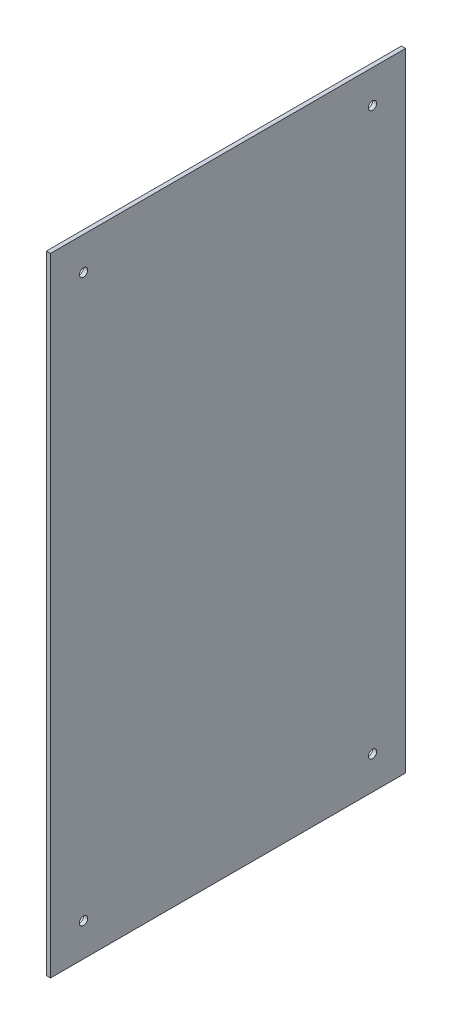
ISO-10303-21;
HEADER;
FILE_DESCRIPTION(('STEP AP214'),'2;1');
FILE_NAME('part.step','',(''),(''),'','','');
FILE_SCHEMA(('AUTOMOTIVE_DESIGN { 1 0 10303 214 1 1 1 1 }'));
ENDSEC;
DATA;
#1=APPLICATION_CONTEXT('core data for automotive mechanical design processes');
#2=APPLICATION_PROTOCOL_DEFINITION('international standard','automotive_design',2000,#1);
#3=PRODUCT_CONTEXT('',#1,'mechanical');
#4=PRODUCT('Part','Part','',(#3));
#5=PRODUCT_RELATED_PRODUCT_CATEGORY('part','',(#4));
#6=PRODUCT_DEFINITION_FORMATION('','',#4);
#7=PRODUCT_DEFINITION_CONTEXT('part definition',#1,'design');
#8=PRODUCT_DEFINITION('design','',#6,#7);
#9=PRODUCT_DEFINITION_SHAPE('','',#8);
#10=(LENGTH_UNIT() NAMED_UNIT(*) SI_UNIT(.MILLI.,.METRE.));
#11=(NAMED_UNIT(*) PLANE_ANGLE_UNIT() SI_UNIT($,.RADIAN.));
#12=(NAMED_UNIT(*) SI_UNIT($,.STERADIAN.) SOLID_ANGLE_UNIT());
#13=UNCERTAINTY_MEASURE_WITH_UNIT(LENGTH_MEASURE(1.E-05),#10,'distance_accuracy_value','');
#14=(GEOMETRIC_REPRESENTATION_CONTEXT(3) GLOBAL_UNCERTAINTY_ASSIGNED_CONTEXT((#13)) GLOBAL_UNIT_ASSIGNED_CONTEXT((#10,
#11,#12)) REPRESENTATION_CONTEXT('',''));
#15=CARTESIAN_POINT('',(0.,0.,0.));
#16=DIRECTION('',(0.,0.,1.));
#17=DIRECTION('',(1.,0.,0.));
#18=AXIS2_PLACEMENT_3D('',#15,#16,#17);
#19=CARTESIAN_POINT('',(3.175,0.,0.));
#20=DIRECTION('',(1.,0.,0.));
#21=DIRECTION('',(0.,0.,-1.));
#22=AXIS2_PLACEMENT_3D('',#19,#20,#21);
#23=PLANE('',#22);
#24=CARTESIAN_POINT('',(3.175,25.4,-247.65));
#25=DIRECTION('',(1.,0.,0.));
#26=DIRECTION('',(0.,0.,-1.));
#27=AXIS2_PLACEMENT_3D('',#24,#25,#26);
#28=CIRCLE('',#27,3.175);
#29=CARTESIAN_POINT('',(3.175,25.4,-250.825));
#30=VERTEX_POINT('',#29);
#31=EDGE_CURVE('E92',#30,#30,#28,.F.);
#32=ORIENTED_EDGE('',*,*,#31,.T.);
#33=EDGE_LOOP('',(#32));
#34=FACE_BOUND('',#33,.T.);
#35=CARTESIAN_POINT('',(3.175,25.4,-25.4));
#36=DIRECTION('',(1.,0.,0.));
#37=DIRECTION('',(0.,0.,-1.));
#38=AXIS2_PLACEMENT_3D('',#35,#36,#37);
#39=CIRCLE('',#38,3.175);
#40=CARTESIAN_POINT('',(3.175,25.4,-28.575));
#41=VERTEX_POINT('',#40);
#42=EDGE_CURVE('E95',#41,#41,#39,.F.);
#43=ORIENTED_EDGE('',*,*,#42,.T.);
#44=EDGE_LOOP('',(#43));
#45=FACE_BOUND('',#44,.T.);
#46=CARTESIAN_POINT('',(3.175,457.2,-247.65));
#47=DIRECTION('',(1.,0.,0.));
#48=DIRECTION('',(0.,0.,-1.));
#49=AXIS2_PLACEMENT_3D('',#46,#47,#48);
#50=CIRCLE('',#49,3.175);
#51=CARTESIAN_POINT('',(3.175,457.2,-250.825));
#52=VERTEX_POINT('',#51);
#53=EDGE_CURVE('E97',#52,#52,#50,.F.);
#54=ORIENTED_EDGE('',*,*,#53,.T.);
#55=EDGE_LOOP('',(#54));
#56=FACE_BOUND('',#55,.T.);
#57=CARTESIAN_POINT('',(3.175,457.2,-25.4));
#58=DIRECTION('',(1.,0.,0.));
#59=DIRECTION('',(0.,0.,-1.));
#60=AXIS2_PLACEMENT_3D('',#57,#58,#59);
#61=CIRCLE('',#60,3.175);
#62=CARTESIAN_POINT('',(3.175,457.2,-28.575));
#63=VERTEX_POINT('',#62);
#64=EDGE_CURVE('E20',#63,#63,#61,.F.);
#65=ORIENTED_EDGE('',*,*,#64,.T.);
#66=EDGE_LOOP('',(#65));
#67=FACE_BOUND('',#66,.T.);
#68=DIRECTION('',(0.,1.,0.));
#69=VECTOR('',#68,1.);
#70=CARTESIAN_POINT('',(3.175,482.6,0.));
#71=LINE('',#70,#69);
#72=CARTESIAN_POINT('',(3.175,0.,0.));
#73=VERTEX_POINT('',#72);
#74=CARTESIAN_POINT('',(3.175,482.6,0.));
#75=VERTEX_POINT('',#74);
#76=EDGE_CURVE('E71',#73,#75,#71,.T.);
#77=ORIENTED_EDGE('',*,*,#76,.F.);
#78=DIRECTION('',(0.,0.,-1.));
#79=VECTOR('',#78,1.);
#80=CARTESIAN_POINT('',(3.175,0.,0.));
#81=LINE('',#80,#79);
#82=CARTESIAN_POINT('',(3.175,0.,-273.05));
#83=VERTEX_POINT('',#82);
#84=EDGE_CURVE('E68',#83,#73,#81,.F.);
#85=ORIENTED_EDGE('',*,*,#84,.F.);
#86=DIRECTION('',(0.,1.,0.));
#87=VECTOR('',#86,1.);
#88=CARTESIAN_POINT('',(3.175,0.,-273.05));
#89=LINE('',#88,#87);
#90=CARTESIAN_POINT('',(3.175,482.6,-273.05));
#91=VERTEX_POINT('',#90);
#92=EDGE_CURVE('E59',#91,#83,#89,.F.);
#93=ORIENTED_EDGE('',*,*,#92,.F.);
#94=DIRECTION('',(0.,0.,1.));
#95=VECTOR('',#94,1.);
#96=CARTESIAN_POINT('',(3.175,482.6,-273.05));
#97=LINE('',#96,#95);
#98=EDGE_CURVE('E54',#75,#91,#97,.F.);
#99=ORIENTED_EDGE('',*,*,#98,.F.);
#100=EDGE_LOOP('',(#77,#85,#93,#99));
#101=FACE_BOUND('',#100,.T.);
#102=ADVANCED_FACE('F17',(#34,#45,#56,#67,#101),#23,.T.);
#103=CARTESIAN_POINT('',(0.,0.,0.));
#104=DIRECTION('',(0.,-1.,0.));
#105=DIRECTION('',(0.,0.,-1.));
#106=AXIS2_PLACEMENT_3D('',#103,#104,#105);
#107=PLANE('',#106);
#108=DIRECTION('',(1.,0.,0.));
#109=VECTOR('',#108,1.);
#110=CARTESIAN_POINT('',(0.,0.,0.));
#111=LINE('',#110,#109);
#112=CARTESIAN_POINT('',(0.,0.,0.));
#113=VERTEX_POINT('',#112);
#114=EDGE_CURVE('E105',#113,#73,#111,.T.);
#115=ORIENTED_EDGE('',*,*,#114,.F.);
#116=DIRECTION('',(0.,0.,-1.));
#117=VECTOR('',#116,1.);
#118=CARTESIAN_POINT('',(0.,0.,0.));
#119=LINE('',#118,#117);
#120=CARTESIAN_POINT('',(0.,0.,-273.05));
#121=VERTEX_POINT('',#120);
#122=EDGE_CURVE('E78',#113,#121,#119,.T.);
#123=ORIENTED_EDGE('',*,*,#122,.T.);
#124=DIRECTION('',(-1.,0.,0.));
#125=VECTOR('',#124,1.);
#126=CARTESIAN_POINT('',(0.,0.,-273.05));
#127=LINE('',#126,#125);
#128=EDGE_CURVE('E64',#83,#121,#127,.T.);
#129=ORIENTED_EDGE('',*,*,#128,.F.);
#130=ORIENTED_EDGE('',*,*,#84,.T.);
#131=EDGE_LOOP('',(#115,#123,#129,#130));
#132=FACE_BOUND('',#131,.T.);
#133=ADVANCED_FACE('F77',(#132),#107,.T.);
#134=CARTESIAN_POINT('',(0.,0.,-273.05));
#135=DIRECTION('',(0.,0.,-1.));
#136=DIRECTION('',(-1.,0.,0.));
#137=AXIS2_PLACEMENT_3D('',#134,#135,#136);
#138=PLANE('',#137);
#139=ORIENTED_EDGE('',*,*,#128,.T.);
#140=DIRECTION('',(0.,1.,0.));
#141=VECTOR('',#140,1.);
#142=CARTESIAN_POINT('',(0.,0.,-273.05));
#143=LINE('',#142,#141);
#144=CARTESIAN_POINT('',(0.,482.6,-273.05));
#145=VERTEX_POINT('',#144);
#146=EDGE_CURVE('E116',#121,#145,#143,.T.);
#147=ORIENTED_EDGE('',*,*,#146,.T.);
#148=DIRECTION('',(1.,0.,0.));
#149=VECTOR('',#148,1.);
#150=CARTESIAN_POINT('',(0.,482.6,-273.05));
#151=LINE('',#150,#149);
#152=EDGE_CURVE('E66',#91,#145,#151,.F.);
#153=ORIENTED_EDGE('',*,*,#152,.F.);
#154=ORIENTED_EDGE('',*,*,#92,.T.);
#155=EDGE_LOOP('',(#139,#147,#153,#154));
#156=FACE_BOUND('',#155,.T.);
#157=ADVANCED_FACE('F61',(#156),#138,.T.);
#158=CARTESIAN_POINT('',(0.,482.6,-273.05));
#159=DIRECTION('',(0.,1.,0.));
#160=DIRECTION('',(0.,0.,1.));
#161=AXIS2_PLACEMENT_3D('',#158,#159,#160);
#162=PLANE('',#161);
#163=ORIENTED_EDGE('',*,*,#152,.T.);
#164=DIRECTION('',(0.,0.,-1.));
#165=VECTOR('',#164,1.);
#166=CARTESIAN_POINT('',(0.,482.6,0.));
#167=LINE('',#166,#165);
#168=CARTESIAN_POINT('',(0.,482.6,0.));
#169=VERTEX_POINT('',#168);
#170=EDGE_CURVE('E113',#145,#169,#167,.F.);
#171=ORIENTED_EDGE('',*,*,#170,.T.);
#172=DIRECTION('',(1.,0.,0.));
#173=VECTOR('',#172,1.);
#174=CARTESIAN_POINT('',(0.,482.6,0.));
#175=LINE('',#174,#173);
#176=EDGE_CURVE('E35',#75,#169,#175,.F.);
#177=ORIENTED_EDGE('',*,*,#176,.F.);
#178=ORIENTED_EDGE('',*,*,#98,.T.);
#179=EDGE_LOOP('',(#163,#171,#177,#178));
#180=FACE_BOUND('',#179,.T.);
#181=ADVANCED_FACE('F112',(#180),#162,.T.);
#182=CARTESIAN_POINT('',(0.,482.6,0.));
#183=DIRECTION('',(0.,0.,1.));
#184=DIRECTION('',(1.,0.,0.));
#185=AXIS2_PLACEMENT_3D('',#182,#183,#184);
#186=PLANE('',#185);
#187=ORIENTED_EDGE('',*,*,#176,.T.);
#188=DIRECTION('',(0.,1.,0.));
#189=VECTOR('',#188,1.);
#190=CARTESIAN_POINT('',(0.,0.,0.));
#191=LINE('',#190,#189);
#192=EDGE_CURVE('E91',#169,#113,#191,.F.);
#193=ORIENTED_EDGE('',*,*,#192,.T.);
#194=ORIENTED_EDGE('',*,*,#114,.T.);
#195=ORIENTED_EDGE('',*,*,#76,.T.);
#196=EDGE_LOOP('',(#187,#193,#194,#195));
#197=FACE_BOUND('',#196,.T.);
#198=ADVANCED_FACE('F119',(#197),#186,.T.);
#199=CARTESIAN_POINT('',(3.175,457.2,-25.4));
#200=DIRECTION('',(1.,0.,0.));
#201=DIRECTION('',(0.,0.,-1.));
#202=AXIS2_PLACEMENT_3D('',#199,#200,#201);
#203=CYLINDRICAL_SURFACE('',#202,3.175);
#204=ORIENTED_EDGE('',*,*,#64,.F.);
#205=EDGE_LOOP('',(#204));
#206=FACE_BOUND('',#205,.T.);
#207=CARTESIAN_POINT('',(0.,457.2,-25.4));
#208=DIRECTION('',(1.,0.,0.));
#209=DIRECTION('',(0.,0.,-1.));
#210=AXIS2_PLACEMENT_3D('',#207,#208,#209);
#211=CIRCLE('',#210,3.175);
#212=CARTESIAN_POINT('',(0.,457.2,-28.575));
#213=VERTEX_POINT('',#212);
#214=EDGE_CURVE('E88',#213,#213,#211,.F.);
#215=ORIENTED_EDGE('',*,*,#214,.T.);
#216=EDGE_LOOP('',(#215));
#217=FACE_BOUND('',#216,.T.);
#218=ADVANCED_FACE('F121',(#206,#217),#203,.F.);
#219=CARTESIAN_POINT('',(3.175,457.2,-247.65));
#220=DIRECTION('',(1.,0.,0.));
#221=DIRECTION('',(0.,0.,-1.));
#222=AXIS2_PLACEMENT_3D('',#219,#220,#221);
#223=CYLINDRICAL_SURFACE('',#222,3.175);
#224=ORIENTED_EDGE('',*,*,#53,.F.);
#225=EDGE_LOOP('',(#224));
#226=FACE_BOUND('',#225,.T.);
#227=CARTESIAN_POINT('',(0.,457.2,-247.65));
#228=DIRECTION('',(1.,0.,0.));
#229=DIRECTION('',(0.,0.,-1.));
#230=AXIS2_PLACEMENT_3D('',#227,#228,#229);
#231=CIRCLE('',#230,3.175);
#232=CARTESIAN_POINT('',(0.,457.2,-250.825));
#233=VERTEX_POINT('',#232);
#234=EDGE_CURVE('E85',#233,#233,#231,.F.);
#235=ORIENTED_EDGE('',*,*,#234,.T.);
#236=EDGE_LOOP('',(#235));
#237=FACE_BOUND('',#236,.T.);
#238=ADVANCED_FACE('F128',(#226,#237),#223,.F.);
#239=CARTESIAN_POINT('',(3.175,25.4,-25.4));
#240=DIRECTION('',(1.,0.,0.));
#241=DIRECTION('',(0.,0.,-1.));
#242=AXIS2_PLACEMENT_3D('',#239,#240,#241);
#243=CYLINDRICAL_SURFACE('',#242,3.175);
#244=ORIENTED_EDGE('',*,*,#42,.F.);
#245=EDGE_LOOP('',(#244));
#246=FACE_BOUND('',#245,.T.);
#247=CARTESIAN_POINT('',(0.,25.4,-25.4));
#248=DIRECTION('',(1.,0.,0.));
#249=DIRECTION('',(0.,0.,-1.));
#250=AXIS2_PLACEMENT_3D('',#247,#248,#249);
#251=CIRCLE('',#250,3.175);
#252=CARTESIAN_POINT('',(0.,25.4,-28.575));
#253=VERTEX_POINT('',#252);
#254=EDGE_CURVE('E26',#253,#253,#251,.F.);
#255=ORIENTED_EDGE('',*,*,#254,.T.);
#256=EDGE_LOOP('',(#255));
#257=FACE_BOUND('',#256,.T.);
#258=ADVANCED_FACE('F139',(#246,#257),#243,.F.);
#259=CARTESIAN_POINT('',(3.175,25.4,-247.65));
#260=DIRECTION('',(1.,0.,0.));
#261=DIRECTION('',(0.,0.,-1.));
#262=AXIS2_PLACEMENT_3D('',#259,#260,#261);
#263=CYLINDRICAL_SURFACE('',#262,3.175);
#264=ORIENTED_EDGE('',*,*,#31,.F.);
#265=EDGE_LOOP('',(#264));
#266=FACE_BOUND('',#265,.T.);
#267=CARTESIAN_POINT('',(0.,25.4,-247.65));
#268=DIRECTION('',(1.,0.,0.));
#269=DIRECTION('',(0.,0.,-1.));
#270=AXIS2_PLACEMENT_3D('',#267,#268,#269);
#271=CIRCLE('',#270,3.175);
#272=CARTESIAN_POINT('',(0.,25.4,-250.825));
#273=VERTEX_POINT('',#272);
#274=EDGE_CURVE('E11',#273,#273,#271,.F.);
#275=ORIENTED_EDGE('',*,*,#274,.T.);
#276=EDGE_LOOP('',(#275));
#277=FACE_BOUND('',#276,.T.);
#278=ADVANCED_FACE('F133',(#266,#277),#263,.F.);
#279=CARTESIAN_POINT('',(0.,0.,0.));
#280=DIRECTION('',(1.,0.,0.));
#281=DIRECTION('',(0.,0.,-1.));
#282=AXIS2_PLACEMENT_3D('',#279,#280,#281);
#283=PLANE('',#282);
#284=ORIENTED_EDGE('',*,*,#274,.F.);
#285=EDGE_LOOP('',(#284));
#286=FACE_BOUND('',#285,.T.);
#287=ORIENTED_EDGE('',*,*,#254,.F.);
#288=EDGE_LOOP('',(#287));
#289=FACE_BOUND('',#288,.T.);
#290=ORIENTED_EDGE('',*,*,#234,.F.);
#291=EDGE_LOOP('',(#290));
#292=FACE_BOUND('',#291,.T.);
#293=ORIENTED_EDGE('',*,*,#214,.F.);
#294=EDGE_LOOP('',(#293));
#295=FACE_BOUND('',#294,.T.);
#296=ORIENTED_EDGE('',*,*,#170,.F.);
#297=ORIENTED_EDGE('',*,*,#146,.F.);
#298=ORIENTED_EDGE('',*,*,#122,.F.);
#299=ORIENTED_EDGE('',*,*,#192,.F.);
#300=EDGE_LOOP('',(#296,#297,#298,#299));
#301=FACE_BOUND('',#300,.T.);
#302=ADVANCED_FACE('F115',(#286,#289,#292,#295,#301),#283,.F.);
#303=CLOSED_SHELL('',(#102,#133,#157,#181,#198,#218,#238,#258,#278,#302));
#304=MANIFOLD_SOLID_BREP('B1',#303);
#305=ADVANCED_BREP_SHAPE_REPRESENTATION('',(#18,#304),#14);
#306=SHAPE_DEFINITION_REPRESENTATION(#9,#305);
ENDSEC;
END-ISO-10303-21;
